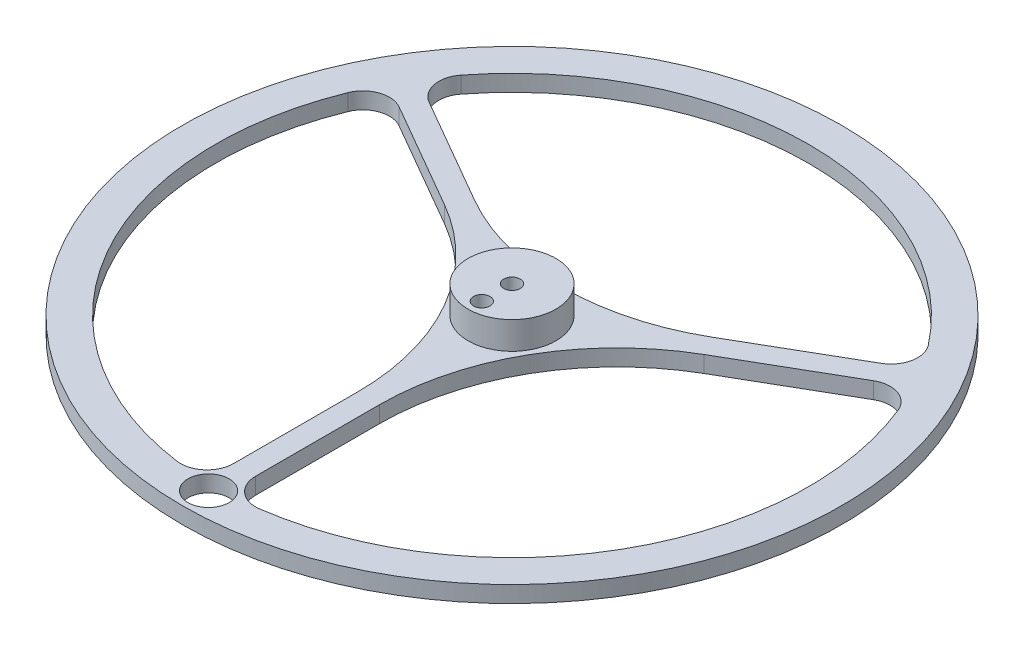
ISO-10303-21;
HEADER;
FILE_DESCRIPTION(('STEP AP214'),'2;1');
FILE_NAME('part.step','',(''),(''),'','','');
FILE_SCHEMA(('AUTOMOTIVE_DESIGN { 1 0 10303 214 1 1 1 1 }'));
ENDSEC;
DATA;
#1=APPLICATION_CONTEXT('core data for automotive mechanical design processes');
#2=APPLICATION_PROTOCOL_DEFINITION('international standard','automotive_design',2000,#1);
#3=PRODUCT_CONTEXT('',#1,'mechanical');
#4=PRODUCT('Part','Part','',(#3));
#5=PRODUCT_RELATED_PRODUCT_CATEGORY('part','',(#4));
#6=PRODUCT_DEFINITION_FORMATION('','',#4);
#7=PRODUCT_DEFINITION_CONTEXT('part definition',#1,'design');
#8=PRODUCT_DEFINITION('design','',#6,#7);
#9=PRODUCT_DEFINITION_SHAPE('','',#8);
#10=(LENGTH_UNIT() NAMED_UNIT(*) SI_UNIT(.MILLI.,.METRE.));
#11=(NAMED_UNIT(*) PLANE_ANGLE_UNIT() SI_UNIT($,.RADIAN.));
#12=(NAMED_UNIT(*) SI_UNIT($,.STERADIAN.) SOLID_ANGLE_UNIT());
#13=UNCERTAINTY_MEASURE_WITH_UNIT(LENGTH_MEASURE(1.E-05),#10,'distance_accuracy_value','');
#14=(GEOMETRIC_REPRESENTATION_CONTEXT(3) GLOBAL_UNCERTAINTY_ASSIGNED_CONTEXT((#13)) GLOBAL_UNIT_ASSIGNED_CONTEXT((#10,
#11,#12)) REPRESENTATION_CONTEXT('',''));
#15=CARTESIAN_POINT('',(0.,0.,0.));
#16=DIRECTION('',(0.,0.,1.));
#17=DIRECTION('',(1.,0.,0.));
#18=AXIS2_PLACEMENT_3D('',#15,#16,#17);
#19=CARTESIAN_POINT('',(-132.141421356237,0.,0.));
#20=DIRECTION('',(0.,1.,0.));
#21=DIRECTION('',(0.,0.,1.));
#22=AXIS2_PLACEMENT_3D('',#19,#20,#21);
#23=PLANE('',#22);
#24=CARTESIAN_POINT('',(0.,0.,55.25));
#25=DIRECTION('',(0.,1.,0.));
#26=DIRECTION('',(0.,0.,1.));
#27=AXIS2_PLACEMENT_3D('',#24,#25,#26);
#28=CIRCLE('',#27,3.75);
#29=CARTESIAN_POINT('',(0.,0.,59.));
#30=VERTEX_POINT('',#29);
#31=EDGE_CURVE('E499',#30,#30,#28,.T.);
#32=ORIENTED_EDGE('',*,*,#31,.F.);
#33=EDGE_LOOP('',(#32));
#34=FACE_BOUND('',#33,.T.);
#35=CARTESIAN_POINT('',(0.,0.,0.));
#36=DIRECTION('',(0.,1.,0.));
#37=DIRECTION('',(0.,0.,1.));
#38=AXIS2_PLACEMENT_3D('',#35,#36,#37);
#39=CIRCLE('',#38,60.);
#40=CARTESIAN_POINT('',(0.,0.,60.));
#41=VERTEX_POINT('',#40);
#42=EDGE_CURVE('E239',#41,#41,#39,.T.);
#43=ORIENTED_EDGE('',*,*,#42,.T.);
#44=EDGE_LOOP('',(#43));
#45=FACE_BOUND('',#44,.T.);
#46=CARTESIAN_POINT('',(0.,0.,0.));
#47=DIRECTION('',(0.,1.,0.));
#48=DIRECTION('',(0.,0.,1.));
#49=AXIS2_PLACEMENT_3D('',#46,#47,#48);
#50=CIRCLE('',#49,54.);
#51=CARTESIAN_POINT('',(-50.0621204437888,0.,-20.2431246765806));
#52=VERTEX_POINT('',#51);
#53=CARTESIAN_POINT('',(-7.5,0.,53.4766304099277));
#54=VERTEX_POINT('',#53);
#55=EDGE_CURVE('E202',#52,#54,#50,.T.);
#56=ORIENTED_EDGE('',*,*,#55,.F.);
#57=CARTESIAN_POINT('',(-45.5850204078836,0.,-18.4327640004259));
#58=DIRECTION('',(0.,1.,0.));
#59=DIRECTION('',(0.,0.,1.));
#60=AXIS2_PLACEMENT_3D('',#57,#58,#59);
#61=CIRCLE('',#60,4.82926811321019);
#62=CARTESIAN_POINT('',(-43.1703863512785,0.,-22.6150328681521));
#63=VERTEX_POINT('',#62);
#64=EDGE_CURVE('E228',#63,#52,#61,.T.);
#65=ORIENTED_EDGE('',*,*,#64,.F.);
#66=DIRECTION('',(0.866025403784437,0.,0.500000000000002));
#67=VECTOR('',#66,1.);
#68=CARTESIAN_POINT('',(-100.106066119377,0.,-55.4868629087586));
#69=LINE('',#68,#67);
#70=CARTESIAN_POINT('',(-23.6243550945525,0.,-11.3301264604924));
#71=VERTEX_POINT('',#70);
#72=EDGE_CURVE('E230',#63,#71,#69,.T.);
#73=ORIENTED_EDGE('',*,*,#72,.T.);
#74=CARTESIAN_POINT('',(-45.2487099847053,0.,26.124354890153));
#75=DIRECTION('',(0.,1.,0.));
#76=DIRECTION('',(0.,0.,1.));
#77=AXIS2_PLACEMENT_3D('',#74,#75,#76);
#78=CIRCLE('',#77,43.2487097803058);
#79=CARTESIAN_POINT('',(-2.0000002043995,0.,26.1243548901531));
#80=VERTEX_POINT('',#79);
#81=EDGE_CURVE('E233',#80,#71,#78,.T.);
#82=ORIENTED_EDGE('',*,*,#81,.F.);
#83=DIRECTION('',(0.,0.,1.));
#84=VECTOR('',#83,1.);
#85=CARTESIAN_POINT('',(-2.0000002043995,0.,0.));
#86=LINE('',#85,#84);
#87=CARTESIAN_POINT('',(-2.0000002043995,0.,48.6941677054723));
#88=VERTEX_POINT('',#87);
#89=EDGE_CURVE('E174',#80,#88,#86,.T.);
#90=ORIENTED_EDGE('',*,*,#89,.T.);
#91=CARTESIAN_POINT('',(-6.8292683176097,0.,48.6941677054723));
#92=DIRECTION('',(0.,1.,0.));
#93=DIRECTION('',(0.,0.,1.));
#94=AXIS2_PLACEMENT_3D('',#91,#92,#93);
#95=CIRCLE('',#94,4.82926811321019);
#96=EDGE_CURVE('E236',#88,#54,#95,.F.);
#97=ORIENTED_EDGE('',*,*,#96,.T.);
#98=EDGE_LOOP('',(#56,#65,#73,#82,#90,#97));
#99=FACE_BOUND('',#98,.T.);
#100=CARTESIAN_POINT('',(42.5621204437888,0.,-33.2335057333471));
#101=VERTEX_POINT('',#100);
#102=CARTESIAN_POINT('',(-42.5621204437888,0.,-33.2335057333471));
#103=VERTEX_POINT('',#102);
#104=EDGE_CURVE('E203',#101,#103,#50,.T.);
#105=ORIENTED_EDGE('',*,*,#104,.F.);
#106=CARTESIAN_POINT('',(38.755752090274,0.,-30.2614037050463));
#107=DIRECTION('',(0.,1.,0.));
#108=DIRECTION('',(0.,0.,1.));
#109=AXIS2_PLACEMENT_3D('',#106,#107,#108);
#110=CIRCLE('',#109,4.82926811321023);
#111=CARTESIAN_POINT('',(41.1703861468791,0.,-26.0791348373201));
#112=VERTEX_POINT('',#111);
#113=EDGE_CURVE('E217',#112,#101,#110,.T.);
#114=ORIENTED_EDGE('',*,*,#113,.F.);
#115=DIRECTION('',(0.86602540378444,0.,-0.499999999999999));
#116=VECTOR('',#115,1.);
#117=CARTESIAN_POINT('',(-100.106066119378,0.,55.4868629087584));
#118=LINE('',#117,#116);
#119=CARTESIAN_POINT('',(21.624354890153,0.,-14.7942284296605));
#120=VERTEX_POINT('',#119);
#121=EDGE_CURVE('E219',#120,#112,#118,.T.);
#122=ORIENTED_EDGE('',*,*,#121,.F.);
#123=CARTESIAN_POINT('',(0.,0.,-52.2487097803058));
#124=DIRECTION('',(0.,1.,0.));
#125=DIRECTION('',(0.,0.,1.));
#126=AXIS2_PLACEMENT_3D('',#123,#124,#125);
#127=CIRCLE('',#126,43.2487097803058);
#128=CARTESIAN_POINT('',(-21.624354890153,0.,-14.7942284296605));
#129=VERTEX_POINT('',#128);
#130=EDGE_CURVE('E221',#129,#120,#127,.T.);
#131=ORIENTED_EDGE('',*,*,#130,.F.);
#132=DIRECTION('',(0.866025403784438,0.,0.500000000000002));
#133=VECTOR('',#132,1.);
#134=CARTESIAN_POINT('',(-98.1060659149781,0.,-58.9509648779266));
#135=LINE('',#134,#133);
#136=CARTESIAN_POINT('',(-41.170386146879,0.,-26.0791348373202));
#137=VERTEX_POINT('',#136);
#138=EDGE_CURVE('E223',#137,#129,#135,.T.);
#139=ORIENTED_EDGE('',*,*,#138,.F.);
#140=CARTESIAN_POINT('',(-38.7557520902739,0.,-30.2614037050463));
#141=DIRECTION('',(0.,1.,0.));
#142=DIRECTION('',(0.,0.,1.));
#143=AXIS2_PLACEMENT_3D('',#140,#141,#142);
#144=CIRCLE('',#143,4.82926811321019);
#145=EDGE_CURVE('E225',#137,#103,#144,.F.);
#146=ORIENTED_EDGE('',*,*,#145,.T.);
#147=EDGE_LOOP('',(#105,#114,#122,#131,#139,#146));
#148=FACE_BOUND('',#147,.T.);
#149=CARTESIAN_POINT('',(7.5,0.,53.4766304099277));
#150=VERTEX_POINT('',#149);
#151=CARTESIAN_POINT('',(50.0621204437888,0.,-20.2431246765805));
#152=VERTEX_POINT('',#151);
#153=EDGE_CURVE('E197',#150,#152,#50,.T.);
#154=ORIENTED_EDGE('',*,*,#153,.F.);
#155=CARTESIAN_POINT('',(6.8292683176097,0.,48.6941677054723));
#156=DIRECTION('',(0.,1.,0.));
#157=DIRECTION('',(0.,0.,1.));
#158=AXIS2_PLACEMENT_3D('',#155,#156,#157);
#159=CIRCLE('',#158,4.82926811321019);
#160=CARTESIAN_POINT('',(2.0000002043995,0.,48.6941677054723));
#161=VERTEX_POINT('',#160);
#162=EDGE_CURVE('E200',#161,#150,#159,.T.);
#163=ORIENTED_EDGE('',*,*,#162,.F.);
#164=DIRECTION('',(0.,0.,-1.));
#165=VECTOR('',#164,1.);
#166=CARTESIAN_POINT('',(2.0000002043995,0.,0.));
#167=LINE('',#166,#165);
#168=CARTESIAN_POINT('',(2.0000002043995,0.,26.1243548901531));
#169=VERTEX_POINT('',#168);
#170=EDGE_CURVE('E205',#161,#169,#167,.T.);
#171=ORIENTED_EDGE('',*,*,#170,.T.);
#172=CARTESIAN_POINT('',(45.2487099847054,0.,26.124354890153));
#173=DIRECTION('',(0.,1.,0.));
#174=DIRECTION('',(0.,0.,1.));
#175=AXIS2_PLACEMENT_3D('',#172,#173,#174);
#176=CIRCLE('',#175,43.2487097803058);
#177=CARTESIAN_POINT('',(23.6243550945525,0.,-11.3301264604924));
#178=VERTEX_POINT('',#177);
#179=EDGE_CURVE('E208',#178,#169,#176,.T.);
#180=ORIENTED_EDGE('',*,*,#179,.F.);
#181=DIRECTION('',(0.866025403784439,0.,-0.5));
#182=VECTOR('',#181,1.);
#183=CARTESIAN_POINT('',(-98.1060659149782,0.,58.9509648779266));
#184=LINE('',#183,#182);
#185=CARTESIAN_POINT('',(43.1703863512786,0.,-22.615032868152));
#186=VERTEX_POINT('',#185);
#187=EDGE_CURVE('E211',#178,#186,#184,.T.);
#188=ORIENTED_EDGE('',*,*,#187,.T.);
#189=CARTESIAN_POINT('',(45.5850204078837,0.,-18.4327640004259));
#190=DIRECTION('',(0.,1.,0.));
#191=DIRECTION('',(0.,0.,1.));
#192=AXIS2_PLACEMENT_3D('',#189,#190,#191);
#193=CIRCLE('',#192,4.8292681132102);
#194=EDGE_CURVE('E214',#186,#152,#193,.F.);
#195=ORIENTED_EDGE('',*,*,#194,.T.);
#196=EDGE_LOOP('',(#154,#163,#171,#180,#188,#195));
#197=FACE_BOUND('',#196,.T.);
#198=CARTESIAN_POINT('',(0.,0.,0.));
#199=DIRECTION('',(0.,1.,0.));
#200=DIRECTION('',(0.,0.,1.));
#201=AXIS2_PLACEMENT_3D('',#198,#199,#200);
#202=CIRCLE('',#201,8.);
#203=CARTESIAN_POINT('',(0.,0.,8.));
#204=VERTEX_POINT('',#203);
#205=EDGE_CURVE('E516',#204,#204,#202,.T.);
#206=ORIENTED_EDGE('',*,*,#205,.F.);
#207=EDGE_LOOP('',(#206));
#208=FACE_BOUND('',#207,.T.);
#209=ADVANCED_FACE('F36',(#34,#45,#99,#148,#197,#208),#23,.T.);
#210=CARTESIAN_POINT('',(0.,-3.,0.));
#211=DIRECTION('',(0.,1.,0.));
#212=DIRECTION('',(0.,0.,1.));
#213=AXIS2_PLACEMENT_3D('',#210,#211,#212);
#214=CYLINDRICAL_SURFACE('',#213,54.);
#215=ORIENTED_EDGE('',*,*,#55,.T.);
#216=DIRECTION('',(0.,1.,0.));
#217=VECTOR('',#216,1.);
#218=CARTESIAN_POINT('',(-7.5,-3.,53.4766304099277));
#219=LINE('',#218,#217);
#220=CARTESIAN_POINT('',(-7.5,-3.,53.4766304099277));
#221=VERTEX_POINT('',#220);
#222=EDGE_CURVE('E11',#221,#54,#219,.T.);
#223=ORIENTED_EDGE('',*,*,#222,.F.);
#224=CARTESIAN_POINT('',(0.,-3.,0.));
#225=DIRECTION('',(0.,1.,0.));
#226=DIRECTION('',(0.,0.,1.));
#227=AXIS2_PLACEMENT_3D('',#224,#225,#226);
#228=CIRCLE('',#227,54.);
#229=CARTESIAN_POINT('',(-50.0621204437888,-3.,-20.2431246765806));
#230=VERTEX_POINT('',#229);
#231=EDGE_CURVE('E55',#230,#221,#228,.T.);
#232=ORIENTED_EDGE('',*,*,#231,.F.);
#233=DIRECTION('',(0.,1.,0.));
#234=VECTOR('',#233,1.);
#235=CARTESIAN_POINT('',(-50.0621204437888,-3.,-20.2431246765806));
#236=LINE('',#235,#234);
#237=EDGE_CURVE('E247',#230,#52,#236,.T.);
#238=ORIENTED_EDGE('',*,*,#237,.T.);
#239=EDGE_LOOP('',(#215,#223,#232,#238));
#240=FACE_BOUND('',#239,.T.);
#241=ADVANCED_FACE('F325',(#240),#214,.F.);
#242=CARTESIAN_POINT('',(-6.8292683176097,-3.,48.6941677054723));
#243=DIRECTION('',(0.,1.,0.));
#244=DIRECTION('',(0.,0.,1.));
#245=AXIS2_PLACEMENT_3D('',#242,#243,#244);
#246=CYLINDRICAL_SURFACE('',#245,4.82926811321019);
#247=ORIENTED_EDGE('',*,*,#96,.F.);
#248=DIRECTION('',(0.,1.,0.));
#249=VECTOR('',#248,1.);
#250=CARTESIAN_POINT('',(-2.0000002043995,-3.,48.6941677054723));
#251=LINE('',#250,#249);
#252=CARTESIAN_POINT('',(-2.0000002043995,-3.,48.6941677054723));
#253=VERTEX_POINT('',#252);
#254=EDGE_CURVE('E46',#253,#88,#251,.T.);
#255=ORIENTED_EDGE('',*,*,#254,.F.);
#256=CARTESIAN_POINT('',(-6.8292683176097,-3.,48.6941677054723));
#257=DIRECTION('',(0.,1.,0.));
#258=DIRECTION('',(0.,0.,1.));
#259=AXIS2_PLACEMENT_3D('',#256,#257,#258);
#260=CIRCLE('',#259,4.82926811321019);
#261=EDGE_CURVE('E189',#253,#221,#260,.F.);
#262=ORIENTED_EDGE('',*,*,#261,.T.);
#263=ORIENTED_EDGE('',*,*,#222,.T.);
#264=EDGE_LOOP('',(#247,#255,#262,#263));
#265=FACE_BOUND('',#264,.T.);
#266=ADVANCED_FACE('F355',(#265),#246,.F.);
#267=CARTESIAN_POINT('',(-2.0000002043995,-3.,0.));
#268=DIRECTION('',(-1.,0.,0.));
#269=DIRECTION('',(0.,0.,1.));
#270=AXIS2_PLACEMENT_3D('',#267,#268,#269);
#271=PLANE('',#270);
#272=ORIENTED_EDGE('',*,*,#89,.F.);
#273=DIRECTION('',(0.,1.,0.));
#274=VECTOR('',#273,1.);
#275=CARTESIAN_POINT('',(-2.0000002043995,-3.,26.1243548901531));
#276=LINE('',#275,#274);
#277=CARTESIAN_POINT('',(-2.0000002043995,-3.,26.1243548901531));
#278=VERTEX_POINT('',#277);
#279=EDGE_CURVE('E169',#278,#80,#276,.T.);
#280=ORIENTED_EDGE('',*,*,#279,.F.);
#281=DIRECTION('',(0.,0.,1.));
#282=VECTOR('',#281,1.);
#283=CARTESIAN_POINT('',(-2.0000002043995,-3.,0.));
#284=LINE('',#283,#282);
#285=EDGE_CURVE('E173',#278,#253,#284,.T.);
#286=ORIENTED_EDGE('',*,*,#285,.T.);
#287=ORIENTED_EDGE('',*,*,#254,.T.);
#288=EDGE_LOOP('',(#272,#280,#286,#287));
#289=FACE_BOUND('',#288,.T.);
#290=ADVANCED_FACE('F171',(#289),#271,.T.);
#291=CARTESIAN_POINT('',(-45.2487099847053,-3.,26.124354890153));
#292=DIRECTION('',(0.,1.,0.));
#293=DIRECTION('',(0.,0.,1.));
#294=AXIS2_PLACEMENT_3D('',#291,#292,#293);
#295=CYLINDRICAL_SURFACE('',#294,43.2487097803058);
#296=ORIENTED_EDGE('',*,*,#81,.T.);
#297=DIRECTION('',(0.,1.,0.));
#298=VECTOR('',#297,1.);
#299=CARTESIAN_POINT('',(-23.6243550945525,-3.,-11.3301264604924));
#300=LINE('',#299,#298);
#301=CARTESIAN_POINT('',(-23.6243550945525,-3.,-11.3301264604924));
#302=VERTEX_POINT('',#301);
#303=EDGE_CURVE('E178',#302,#71,#300,.T.);
#304=ORIENTED_EDGE('',*,*,#303,.F.);
#305=CARTESIAN_POINT('',(-45.2487099847053,-3.,26.124354890153));
#306=DIRECTION('',(0.,1.,0.));
#307=DIRECTION('',(0.,0.,1.));
#308=AXIS2_PLACEMENT_3D('',#305,#306,#307);
#309=CIRCLE('',#308,43.2487097803058);
#310=EDGE_CURVE('E181',#278,#302,#309,.T.);
#311=ORIENTED_EDGE('',*,*,#310,.F.);
#312=ORIENTED_EDGE('',*,*,#279,.T.);
#313=EDGE_LOOP('',(#296,#304,#311,#312));
#314=FACE_BOUND('',#313,.T.);
#315=ADVANCED_FACE('F182',(#314),#295,.F.);
#316=CARTESIAN_POINT('',(-100.106066119377,-3.,-55.4868629087586));
#317=DIRECTION('',(-0.500000000000002,0.,0.866025403784437));
#318=DIRECTION('',(0.866025403784437,0.,0.500000000000002));
#319=AXIS2_PLACEMENT_3D('',#316,#317,#318);
#320=PLANE('',#319);
#321=ORIENTED_EDGE('',*,*,#72,.F.);
#322=DIRECTION('',(0.,1.,0.));
#323=VECTOR('',#322,1.);
#324=CARTESIAN_POINT('',(-43.1703863512785,-3.,-22.6150328681521));
#325=LINE('',#324,#323);
#326=CARTESIAN_POINT('',(-43.1703863512785,-3.,-22.6150328681521));
#327=VERTEX_POINT('',#326);
#328=EDGE_CURVE('E245',#327,#63,#325,.T.);
#329=ORIENTED_EDGE('',*,*,#328,.F.);
#330=DIRECTION('',(0.866025403784437,0.,0.500000000000002));
#331=VECTOR('',#330,1.);
#332=CARTESIAN_POINT('',(-100.106066119377,-3.,-55.4868629087586));
#333=LINE('',#332,#331);
#334=EDGE_CURVE('E185',#327,#302,#333,.T.);
#335=ORIENTED_EDGE('',*,*,#334,.T.);
#336=ORIENTED_EDGE('',*,*,#303,.T.);
#337=EDGE_LOOP('',(#321,#329,#335,#336));
#338=FACE_BOUND('',#337,.T.);
#339=ADVANCED_FACE('F317',(#338),#320,.T.);
#340=ORIENTED_EDGE('',*,*,#104,.T.);
#341=DIRECTION('',(0.,1.,0.));
#342=VECTOR('',#341,1.);
#343=CARTESIAN_POINT('',(-42.5621204437888,-3.,-33.2335057333471));
#344=LINE('',#343,#342);
#345=CARTESIAN_POINT('',(-42.5621204437888,-3.,-33.2335057333471));
#346=VERTEX_POINT('',#345);
#347=EDGE_CURVE('E250',#346,#103,#344,.T.);
#348=ORIENTED_EDGE('',*,*,#347,.F.);
#349=CARTESIAN_POINT('',(42.5621204437888,-3.,-33.2335057333471));
#350=VERTEX_POINT('',#349);
#351=EDGE_CURVE('E295',#350,#346,#228,.T.);
#352=ORIENTED_EDGE('',*,*,#351,.F.);
#353=DIRECTION('',(0.,1.,0.));
#354=VECTOR('',#353,1.);
#355=CARTESIAN_POINT('',(42.5621204437888,-3.,-33.2335057333471));
#356=LINE('',#355,#354);
#357=EDGE_CURVE('E263',#350,#101,#356,.T.);
#358=ORIENTED_EDGE('',*,*,#357,.T.);
#359=EDGE_LOOP('',(#340,#348,#352,#358));
#360=FACE_BOUND('',#359,.T.);
#361=ADVANCED_FACE('F357',(#360),#214,.F.);
#362=CARTESIAN_POINT('',(-38.7557520902739,-3.,-30.2614037050463));
#363=DIRECTION('',(0.,1.,0.));
#364=DIRECTION('',(0.,0.,1.));
#365=AXIS2_PLACEMENT_3D('',#362,#363,#364);
#366=CYLINDRICAL_SURFACE('',#365,4.82926811321019);
#367=ORIENTED_EDGE('',*,*,#145,.F.);
#368=DIRECTION('',(0.,1.,0.));
#369=VECTOR('',#368,1.);
#370=CARTESIAN_POINT('',(-41.170386146879,-3.,-26.0791348373202));
#371=LINE('',#370,#369);
#372=CARTESIAN_POINT('',(-41.170386146879,-3.,-26.0791348373202));
#373=VERTEX_POINT('',#372);
#374=EDGE_CURVE('E252',#373,#137,#371,.T.);
#375=ORIENTED_EDGE('',*,*,#374,.F.);
#376=CARTESIAN_POINT('',(-38.7557520902739,-3.,-30.2614037050463));
#377=DIRECTION('',(0.,1.,0.));
#378=DIRECTION('',(0.,0.,1.));
#379=AXIS2_PLACEMENT_3D('',#376,#377,#378);
#380=CIRCLE('',#379,4.82926811321019);
#381=EDGE_CURVE('E311',#373,#346,#380,.F.);
#382=ORIENTED_EDGE('',*,*,#381,.T.);
#383=ORIENTED_EDGE('',*,*,#347,.T.);
#384=EDGE_LOOP('',(#367,#375,#382,#383));
#385=FACE_BOUND('',#384,.T.);
#386=ADVANCED_FACE('F373',(#385),#366,.F.);
#387=CARTESIAN_POINT('',(-98.1060659149781,-3.,-58.9509648779266));
#388=DIRECTION('',(-0.500000000000001,0.,0.866025403784438));
#389=DIRECTION('',(0.866025403784438,0.,0.500000000000002));
#390=AXIS2_PLACEMENT_3D('',#387,#388,#389);
#391=PLANE('',#390);
#392=ORIENTED_EDGE('',*,*,#138,.T.);
#393=DIRECTION('',(0.,1.,0.));
#394=VECTOR('',#393,1.);
#395=CARTESIAN_POINT('',(-21.624354890153,-3.,-14.7942284296605));
#396=LINE('',#395,#394);
#397=CARTESIAN_POINT('',(-21.624354890153,-3.,-14.7942284296605));
#398=VERTEX_POINT('',#397);
#399=EDGE_CURVE('E254',#398,#129,#396,.T.);
#400=ORIENTED_EDGE('',*,*,#399,.F.);
#401=DIRECTION('',(0.866025403784438,0.,0.500000000000002));
#402=VECTOR('',#401,1.);
#403=CARTESIAN_POINT('',(-98.1060659149781,-3.,-58.9509648779266));
#404=LINE('',#403,#402);
#405=EDGE_CURVE('E309',#373,#398,#404,.T.);
#406=ORIENTED_EDGE('',*,*,#405,.F.);
#407=ORIENTED_EDGE('',*,*,#374,.T.);
#408=EDGE_LOOP('',(#392,#400,#406,#407));
#409=FACE_BOUND('',#408,.T.);
#410=ADVANCED_FACE('F376',(#409),#391,.F.);
#411=CARTESIAN_POINT('',(0.,-3.,-52.2487097803058));
#412=DIRECTION('',(0.,1.,0.));
#413=DIRECTION('',(0.,0.,1.));
#414=AXIS2_PLACEMENT_3D('',#411,#412,#413);
#415=CYLINDRICAL_SURFACE('',#414,43.2487097803058);
#416=ORIENTED_EDGE('',*,*,#130,.T.);
#417=DIRECTION('',(0.,1.,0.));
#418=VECTOR('',#417,1.);
#419=CARTESIAN_POINT('',(21.624354890153,-3.,-14.7942284296605));
#420=LINE('',#419,#418);
#421=CARTESIAN_POINT('',(21.624354890153,-3.,-14.7942284296605));
#422=VERTEX_POINT('',#421);
#423=EDGE_CURVE('E257',#422,#120,#420,.T.);
#424=ORIENTED_EDGE('',*,*,#423,.F.);
#425=CARTESIAN_POINT('',(0.,-3.,-52.2487097803058));
#426=DIRECTION('',(0.,1.,0.));
#427=DIRECTION('',(0.,0.,1.));
#428=AXIS2_PLACEMENT_3D('',#425,#426,#427);
#429=CIRCLE('',#428,43.2487097803058);
#430=EDGE_CURVE('E307',#398,#422,#429,.T.);
#431=ORIENTED_EDGE('',*,*,#430,.F.);
#432=ORIENTED_EDGE('',*,*,#399,.T.);
#433=EDGE_LOOP('',(#416,#424,#431,#432));
#434=FACE_BOUND('',#433,.T.);
#435=ADVANCED_FACE('F380',(#434),#415,.F.);
#436=CARTESIAN_POINT('',(-100.106066119378,-3.,55.4868629087584));
#437=DIRECTION('',(0.499999999999999,0.,0.866025403784439));
#438=DIRECTION('',(0.866025403784439,0.,-0.499999999999999));
#439=AXIS2_PLACEMENT_3D('',#436,#437,#438);
#440=PLANE('',#439);
#441=ORIENTED_EDGE('',*,*,#121,.T.);
#442=DIRECTION('',(0.,1.,0.));
#443=VECTOR('',#442,1.);
#444=CARTESIAN_POINT('',(41.1703861468791,-3.,-26.0791348373201));
#445=LINE('',#444,#443);
#446=CARTESIAN_POINT('',(41.1703861468791,-3.,-26.0791348373201));
#447=VERTEX_POINT('',#446);
#448=EDGE_CURVE('E260',#447,#112,#445,.T.);
#449=ORIENTED_EDGE('',*,*,#448,.F.);
#450=DIRECTION('',(0.86602540378444,0.,-0.499999999999999));
#451=VECTOR('',#450,1.);
#452=CARTESIAN_POINT('',(-100.106066119378,-3.,55.4868629087584));
#453=LINE('',#452,#451);
#454=EDGE_CURVE('E305',#422,#447,#453,.T.);
#455=ORIENTED_EDGE('',*,*,#454,.F.);
#456=ORIENTED_EDGE('',*,*,#423,.T.);
#457=EDGE_LOOP('',(#441,#449,#455,#456));
#458=FACE_BOUND('',#457,.T.);
#459=ADVANCED_FACE('F384',(#458),#440,.F.);
#460=ORIENTED_EDGE('',*,*,#153,.T.);
#461=DIRECTION('',(0.,1.,0.));
#462=VECTOR('',#461,1.);
#463=CARTESIAN_POINT('',(50.0621204437888,-3.,-20.2431246765805));
#464=LINE('',#463,#462);
#465=CARTESIAN_POINT('',(50.0621204437888,-3.,-20.2431246765805));
#466=VERTEX_POINT('',#465);
#467=EDGE_CURVE('E266',#466,#152,#464,.T.);
#468=ORIENTED_EDGE('',*,*,#467,.F.);
#469=CARTESIAN_POINT('',(7.5,-3.,53.4766304099277));
#470=VERTEX_POINT('',#469);
#471=EDGE_CURVE('E241',#470,#466,#228,.T.);
#472=ORIENTED_EDGE('',*,*,#471,.F.);
#473=DIRECTION('',(0.,1.,0.));
#474=VECTOR('',#473,1.);
#475=CARTESIAN_POINT('',(7.5,-3.,53.4766304099277));
#476=LINE('',#475,#474);
#477=EDGE_CURVE('E40',#470,#150,#476,.T.);
#478=ORIENTED_EDGE('',*,*,#477,.T.);
#479=EDGE_LOOP('',(#460,#468,#472,#478));
#480=FACE_BOUND('',#479,.T.);
#481=ADVANCED_FACE('F280',(#480),#214,.F.);
#482=CARTESIAN_POINT('',(45.5850204078837,-3.,-18.4327640004259));
#483=DIRECTION('',(0.,1.,0.));
#484=DIRECTION('',(0.,0.,1.));
#485=AXIS2_PLACEMENT_3D('',#482,#483,#484);
#486=CYLINDRICAL_SURFACE('',#485,4.8292681132102);
#487=ORIENTED_EDGE('',*,*,#194,.F.);
#488=DIRECTION('',(0.,1.,0.));
#489=VECTOR('',#488,1.);
#490=CARTESIAN_POINT('',(43.1703863512786,-3.,-22.615032868152));
#491=LINE('',#490,#489);
#492=CARTESIAN_POINT('',(43.1703863512786,-3.,-22.615032868152));
#493=VERTEX_POINT('',#492);
#494=EDGE_CURVE('E268',#493,#186,#491,.T.);
#495=ORIENTED_EDGE('',*,*,#494,.F.);
#496=CARTESIAN_POINT('',(45.5850204078837,-3.,-18.4327640004259));
#497=DIRECTION('',(0.,1.,0.));
#498=DIRECTION('',(0.,0.,1.));
#499=AXIS2_PLACEMENT_3D('',#496,#497,#498);
#500=CIRCLE('',#499,4.8292681132102);
#501=EDGE_CURVE('E293',#493,#466,#500,.F.);
#502=ORIENTED_EDGE('',*,*,#501,.T.);
#503=ORIENTED_EDGE('',*,*,#467,.T.);
#504=EDGE_LOOP('',(#487,#495,#502,#503));
#505=FACE_BOUND('',#504,.T.);
#506=ADVANCED_FACE('F289',(#505),#486,.F.);
#507=CARTESIAN_POINT('',(-98.1060659149782,-3.,58.9509648779266));
#508=DIRECTION('',(0.5,0.,0.866025403784439));
#509=DIRECTION('',(0.866025403784439,0.,-0.5));
#510=AXIS2_PLACEMENT_3D('',#507,#508,#509);
#511=PLANE('',#510);
#512=ORIENTED_EDGE('',*,*,#187,.F.);
#513=DIRECTION('',(0.,1.,0.));
#514=VECTOR('',#513,1.);
#515=CARTESIAN_POINT('',(23.6243550945525,-3.,-11.3301264604924));
#516=LINE('',#515,#514);
#517=CARTESIAN_POINT('',(23.6243550945525,-3.,-11.3301264604924));
#518=VERTEX_POINT('',#517);
#519=EDGE_CURVE('E270',#518,#178,#516,.T.);
#520=ORIENTED_EDGE('',*,*,#519,.F.);
#521=DIRECTION('',(0.866025403784439,0.,-0.5));
#522=VECTOR('',#521,1.);
#523=CARTESIAN_POINT('',(-98.1060659149782,-3.,58.9509648779266));
#524=LINE('',#523,#522);
#525=EDGE_CURVE('E296',#518,#493,#524,.T.);
#526=ORIENTED_EDGE('',*,*,#525,.T.);
#527=ORIENTED_EDGE('',*,*,#494,.T.);
#528=EDGE_LOOP('',(#512,#520,#526,#527));
#529=FACE_BOUND('',#528,.T.);
#530=ADVANCED_FACE('F391',(#529),#511,.T.);
#531=CARTESIAN_POINT('',(45.2487099847054,-3.,26.124354890153));
#532=DIRECTION('',(0.,1.,0.));
#533=DIRECTION('',(0.,0.,1.));
#534=AXIS2_PLACEMENT_3D('',#531,#532,#533);
#535=CYLINDRICAL_SURFACE('',#534,43.2487097803058);
#536=ORIENTED_EDGE('',*,*,#179,.T.);
#537=DIRECTION('',(0.,1.,0.));
#538=VECTOR('',#537,1.);
#539=CARTESIAN_POINT('',(2.0000002043995,-3.,26.1243548901531));
#540=LINE('',#539,#538);
#541=CARTESIAN_POINT('',(2.0000002043995,-3.,26.1243548901531));
#542=VERTEX_POINT('',#541);
#543=EDGE_CURVE('E272',#542,#169,#540,.T.);
#544=ORIENTED_EDGE('',*,*,#543,.F.);
#545=CARTESIAN_POINT('',(45.2487099847054,-3.,26.124354890153));
#546=DIRECTION('',(0.,1.,0.));
#547=DIRECTION('',(0.,0.,1.));
#548=AXIS2_PLACEMENT_3D('',#545,#546,#547);
#549=CIRCLE('',#548,43.2487097803058);
#550=EDGE_CURVE('E300',#518,#542,#549,.T.);
#551=ORIENTED_EDGE('',*,*,#550,.F.);
#552=ORIENTED_EDGE('',*,*,#519,.T.);
#553=EDGE_LOOP('',(#536,#544,#551,#552));
#554=FACE_BOUND('',#553,.T.);
#555=ADVANCED_FACE('F335',(#554),#535,.F.);
#556=CARTESIAN_POINT('',(2.0000002043995,-3.,0.));
#557=DIRECTION('',(1.,0.,0.));
#558=DIRECTION('',(0.,0.,-1.));
#559=AXIS2_PLACEMENT_3D('',#556,#557,#558);
#560=PLANE('',#559);
#561=ORIENTED_EDGE('',*,*,#170,.F.);
#562=DIRECTION('',(0.,1.,0.));
#563=VECTOR('',#562,1.);
#564=CARTESIAN_POINT('',(2.0000002043995,-3.,48.6941677054723));
#565=LINE('',#564,#563);
#566=CARTESIAN_POINT('',(2.0000002043995,-3.,48.6941677054723));
#567=VERTEX_POINT('',#566);
#568=EDGE_CURVE('E273',#567,#161,#565,.T.);
#569=ORIENTED_EDGE('',*,*,#568,.F.);
#570=DIRECTION('',(0.,0.,-1.));
#571=VECTOR('',#570,1.);
#572=CARTESIAN_POINT('',(2.0000002043995,-3.,0.));
#573=LINE('',#572,#571);
#574=EDGE_CURVE('E328',#567,#542,#573,.T.);
#575=ORIENTED_EDGE('',*,*,#574,.T.);
#576=ORIENTED_EDGE('',*,*,#543,.T.);
#577=EDGE_LOOP('',(#561,#569,#575,#576));
#578=FACE_BOUND('',#577,.T.);
#579=ADVANCED_FACE('F337',(#578),#560,.T.);
#580=CARTESIAN_POINT('',(-45.5850204078836,-3.,-18.4327640004259));
#581=DIRECTION('',(0.,1.,0.));
#582=DIRECTION('',(0.,0.,1.));
#583=AXIS2_PLACEMENT_3D('',#580,#581,#582);
#584=CYLINDRICAL_SURFACE('',#583,4.82926811321019);
#585=ORIENTED_EDGE('',*,*,#64,.T.);
#586=ORIENTED_EDGE('',*,*,#237,.F.);
#587=CARTESIAN_POINT('',(-45.5850204078836,-3.,-18.4327640004259));
#588=DIRECTION('',(0.,1.,0.));
#589=DIRECTION('',(0.,0.,1.));
#590=AXIS2_PLACEMENT_3D('',#587,#588,#589);
#591=CIRCLE('',#590,4.82926811321019);
#592=EDGE_CURVE('E314',#327,#230,#591,.T.);
#593=ORIENTED_EDGE('',*,*,#592,.F.);
#594=ORIENTED_EDGE('',*,*,#328,.T.);
#595=EDGE_LOOP('',(#585,#586,#593,#594));
#596=FACE_BOUND('',#595,.T.);
#597=ADVANCED_FACE('F321',(#596),#584,.F.);
#598=CARTESIAN_POINT('',(38.755752090274,-3.,-30.2614037050463));
#599=DIRECTION('',(0.,1.,0.));
#600=DIRECTION('',(0.,0.,1.));
#601=AXIS2_PLACEMENT_3D('',#598,#599,#600);
#602=CYLINDRICAL_SURFACE('',#601,4.82926811321023);
#603=ORIENTED_EDGE('',*,*,#113,.T.);
#604=ORIENTED_EDGE('',*,*,#357,.F.);
#605=CARTESIAN_POINT('',(38.755752090274,-3.,-30.2614037050463));
#606=DIRECTION('',(0.,1.,0.));
#607=DIRECTION('',(0.,0.,1.));
#608=AXIS2_PLACEMENT_3D('',#605,#606,#607);
#609=CIRCLE('',#608,4.82926811321023);
#610=EDGE_CURVE('E298',#447,#350,#609,.T.);
#611=ORIENTED_EDGE('',*,*,#610,.F.);
#612=ORIENTED_EDGE('',*,*,#448,.T.);
#613=EDGE_LOOP('',(#603,#604,#611,#612));
#614=FACE_BOUND('',#613,.T.);
#615=ADVANCED_FACE('F340',(#614),#602,.F.);
#616=CARTESIAN_POINT('',(6.8292683176097,-3.,48.6941677054723));
#617=DIRECTION('',(0.,1.,0.));
#618=DIRECTION('',(0.,0.,1.));
#619=AXIS2_PLACEMENT_3D('',#616,#617,#618);
#620=CYLINDRICAL_SURFACE('',#619,4.82926811321019);
#621=ORIENTED_EDGE('',*,*,#162,.T.);
#622=ORIENTED_EDGE('',*,*,#477,.F.);
#623=CARTESIAN_POINT('',(6.8292683176097,-3.,48.6941677054723));
#624=DIRECTION('',(0.,1.,0.));
#625=DIRECTION('',(0.,0.,1.));
#626=AXIS2_PLACEMENT_3D('',#623,#624,#625);
#627=CIRCLE('',#626,4.82926811321019);
#628=EDGE_CURVE('E127',#567,#470,#627,.T.);
#629=ORIENTED_EDGE('',*,*,#628,.F.);
#630=ORIENTED_EDGE('',*,*,#568,.T.);
#631=EDGE_LOOP('',(#621,#622,#629,#630));
#632=FACE_BOUND('',#631,.T.);
#633=ADVANCED_FACE('F38',(#632),#620,.F.);
#634=CARTESIAN_POINT('',(0.,-3.,0.));
#635=DIRECTION('',(0.,1.,0.));
#636=DIRECTION('',(0.,0.,1.));
#637=AXIS2_PLACEMENT_3D('',#634,#635,#636);
#638=CYLINDRICAL_SURFACE('',#637,60.);
#639=CARTESIAN_POINT('',(0.,-3.,0.));
#640=DIRECTION('',(0.,1.,0.));
#641=DIRECTION('',(0.,0.,1.));
#642=AXIS2_PLACEMENT_3D('',#639,#640,#641);
#643=CIRCLE('',#642,60.);
#644=CARTESIAN_POINT('',(0.,-3.,60.));
#645=VERTEX_POINT('',#644);
#646=EDGE_CURVE('E191',#645,#645,#643,.T.);
#647=ORIENTED_EDGE('',*,*,#646,.T.);
#648=EDGE_LOOP('',(#647));
#649=FACE_BOUND('',#648,.T.);
#650=ORIENTED_EDGE('',*,*,#42,.F.);
#651=EDGE_LOOP('',(#650));
#652=FACE_BOUND('',#651,.T.);
#653=ADVANCED_FACE('F339',(#649,#652),#638,.T.);
#654=CARTESIAN_POINT('',(-132.141421356237,-3.,0.));
#655=DIRECTION('',(0.,1.,0.));
#656=DIRECTION('',(0.,0.,1.));
#657=AXIS2_PLACEMENT_3D('',#654,#655,#656);
#658=PLANE('',#657);
#659=CARTESIAN_POINT('',(0.,-3.,55.25));
#660=DIRECTION('',(0.,1.,0.));
#661=DIRECTION('',(0.,0.,1.));
#662=AXIS2_PLACEMENT_3D('',#659,#660,#661);
#663=CIRCLE('',#662,3.75);
#664=CARTESIAN_POINT('',(0.,-3.,59.));
#665=VERTEX_POINT('',#664);
#666=EDGE_CURVE('E503',#665,#665,#663,.F.);
#667=ORIENTED_EDGE('',*,*,#666,.F.);
#668=EDGE_LOOP('',(#667));
#669=FACE_BOUND('',#668,.T.);
#670=CARTESIAN_POINT('',(0.,-3.,0.));
#671=DIRECTION('',(0.,1.,0.));
#672=DIRECTION('',(0.,0.,1.));
#673=AXIS2_PLACEMENT_3D('',#670,#671,#672);
#674=CIRCLE('',#673,1.5);
#675=CARTESIAN_POINT('',(0.,-3.,1.5));
#676=VERTEX_POINT('',#675);
#677=EDGE_CURVE('E513',#676,#676,#674,.F.);
#678=ORIENTED_EDGE('',*,*,#677,.F.);
#679=EDGE_LOOP('',(#678));
#680=FACE_BOUND('',#679,.T.);
#681=ORIENTED_EDGE('',*,*,#471,.T.);
#682=ORIENTED_EDGE('',*,*,#501,.F.);
#683=ORIENTED_EDGE('',*,*,#525,.F.);
#684=ORIENTED_EDGE('',*,*,#550,.T.);
#685=ORIENTED_EDGE('',*,*,#574,.F.);
#686=ORIENTED_EDGE('',*,*,#628,.T.);
#687=EDGE_LOOP('',(#681,#682,#683,#684,#685,#686));
#688=FACE_BOUND('',#687,.T.);
#689=ORIENTED_EDGE('',*,*,#351,.T.);
#690=ORIENTED_EDGE('',*,*,#381,.F.);
#691=ORIENTED_EDGE('',*,*,#405,.T.);
#692=ORIENTED_EDGE('',*,*,#430,.T.);
#693=ORIENTED_EDGE('',*,*,#454,.T.);
#694=ORIENTED_EDGE('',*,*,#610,.T.);
#695=EDGE_LOOP('',(#689,#690,#691,#692,#693,#694));
#696=FACE_BOUND('',#695,.T.);
#697=ORIENTED_EDGE('',*,*,#231,.T.);
#698=ORIENTED_EDGE('',*,*,#261,.F.);
#699=ORIENTED_EDGE('',*,*,#285,.F.);
#700=ORIENTED_EDGE('',*,*,#310,.T.);
#701=ORIENTED_EDGE('',*,*,#334,.F.);
#702=ORIENTED_EDGE('',*,*,#592,.T.);
#703=EDGE_LOOP('',(#697,#698,#699,#700,#701,#702));
#704=FACE_BOUND('',#703,.T.);
#705=ORIENTED_EDGE('',*,*,#646,.F.);
#706=EDGE_LOOP('',(#705));
#707=FACE_BOUND('',#706,.T.);
#708=ADVANCED_FACE('F187',(#669,#680,#688,#696,#704,#707),#658,.F.);
#709=CARTESIAN_POINT('',(0.,5.,0.));
#710=DIRECTION('',(0.,-1.,0.));
#711=DIRECTION('',(0.,0.,-1.));
#712=AXIS2_PLACEMENT_3D('',#709,#710,#711);
#713=CYLINDRICAL_SURFACE('',#712,8.);
#714=CARTESIAN_POINT('',(0.,5.,0.));
#715=DIRECTION('',(0.,1.,0.));
#716=DIRECTION('',(0.,0.,1.));
#717=AXIS2_PLACEMENT_3D('',#714,#715,#716);
#718=CIRCLE('',#717,8.);
#719=CARTESIAN_POINT('',(0.,5.,8.));
#720=VERTEX_POINT('',#719);
#721=EDGE_CURVE('E201',#720,#720,#718,.T.);
#722=ORIENTED_EDGE('',*,*,#721,.F.);
#723=EDGE_LOOP('',(#722));
#724=FACE_BOUND('',#723,.T.);
#725=ORIENTED_EDGE('',*,*,#205,.T.);
#726=EDGE_LOOP('',(#725));
#727=FACE_BOUND('',#726,.T.);
#728=ADVANCED_FACE('F426',(#724,#727),#713,.T.);
#729=CARTESIAN_POINT('',(-132.141421356237,5.,0.));
#730=DIRECTION('',(0.,1.,0.));
#731=DIRECTION('',(0.,0.,1.));
#732=AXIS2_PLACEMENT_3D('',#729,#730,#731);
#733=PLANE('',#732);
#734=CARTESIAN_POINT('',(0.,5.,5.5));
#735=DIRECTION('',(0.,1.,0.));
#736=DIRECTION('',(0.,0.,1.));
#737=AXIS2_PLACEMENT_3D('',#734,#735,#736);
#738=CIRCLE('',#737,1.5);
#739=CARTESIAN_POINT('',(0.,5.,7.));
#740=VERTEX_POINT('',#739);
#741=EDGE_CURVE('E500',#740,#740,#738,.T.);
#742=ORIENTED_EDGE('',*,*,#741,.F.);
#743=EDGE_LOOP('',(#742));
#744=FACE_BOUND('',#743,.T.);
#745=CARTESIAN_POINT('',(0.,5.,0.));
#746=DIRECTION('',(0.,1.,0.));
#747=DIRECTION('',(0.,0.,1.));
#748=AXIS2_PLACEMENT_3D('',#745,#746,#747);
#749=CIRCLE('',#748,1.5);
#750=CARTESIAN_POINT('',(0.,5.,1.5));
#751=VERTEX_POINT('',#750);
#752=EDGE_CURVE('E510',#751,#751,#749,.T.);
#753=ORIENTED_EDGE('',*,*,#752,.F.);
#754=EDGE_LOOP('',(#753));
#755=FACE_BOUND('',#754,.T.);
#756=ORIENTED_EDGE('',*,*,#721,.T.);
#757=EDGE_LOOP('',(#756));
#758=FACE_BOUND('',#757,.T.);
#759=ADVANCED_FACE('F431',(#744,#755,#758),#733,.T.);
#760=CARTESIAN_POINT('',(0.,-3.001,0.));
#761=DIRECTION('',(0.,1.,0.));
#762=DIRECTION('',(0.,0.,1.));
#763=AXIS2_PLACEMENT_3D('',#760,#761,#762);
#764=CYLINDRICAL_SURFACE('',#763,1.5);
#765=ORIENTED_EDGE('',*,*,#752,.T.);
#766=EDGE_LOOP('',(#765));
#767=FACE_BOUND('',#766,.T.);
#768=ORIENTED_EDGE('',*,*,#677,.T.);
#769=EDGE_LOOP('',(#768));
#770=FACE_BOUND('',#769,.T.);
#771=ADVANCED_FACE('F439',(#767,#770),#764,.F.);
#772=CARTESIAN_POINT('',(0.,-3.001,55.25));
#773=DIRECTION('',(0.,1.,0.));
#774=DIRECTION('',(0.,0.,1.));
#775=AXIS2_PLACEMENT_3D('',#772,#773,#774);
#776=CYLINDRICAL_SURFACE('',#775,3.75);
#777=ORIENTED_EDGE('',*,*,#31,.T.);
#778=EDGE_LOOP('',(#777));
#779=FACE_BOUND('',#778,.T.);
#780=ORIENTED_EDGE('',*,*,#666,.T.);
#781=EDGE_LOOP('',(#780));
#782=FACE_BOUND('',#781,.T.);
#783=ADVANCED_FACE('F443',(#779,#782),#776,.F.);
#784=CARTESIAN_POINT('',(0.,-4.24264068711929,5.5));
#785=DIRECTION('',(0.,1.,0.));
#786=DIRECTION('',(0.,0.,1.));
#787=AXIS2_PLACEMENT_3D('',#784,#785,#786);
#788=CYLINDRICAL_SURFACE('',#787,1.5);
#789=CARTESIAN_POINT('',(0.,0.,5.5));
#790=DIRECTION('',(0.,1.,0.));
#791=DIRECTION('',(0.,0.,1.));
#792=AXIS2_PLACEMENT_3D('',#789,#790,#791);
#793=CIRCLE('',#792,1.5);
#794=CARTESIAN_POINT('',(0.,0.,7.));
#795=VERTEX_POINT('',#794);
#796=EDGE_CURVE('E498',#795,#795,#793,.F.);
#797=ORIENTED_EDGE('',*,*,#796,.T.);
#798=EDGE_LOOP('',(#797));
#799=FACE_BOUND('',#798,.T.);
#800=ORIENTED_EDGE('',*,*,#741,.T.);
#801=EDGE_LOOP('',(#800));
#802=FACE_BOUND('',#801,.T.);
#803=ADVANCED_FACE('F465',(#799,#802),#788,.F.);
#804=CARTESIAN_POINT('',(-132.141421356237,0.,0.));
#805=DIRECTION('',(0.,1.,0.));
#806=DIRECTION('',(0.,0.,1.));
#807=AXIS2_PLACEMENT_3D('',#804,#805,#806);
#808=PLANE('',#807);
#809=ORIENTED_EDGE('',*,*,#796,.F.);
#810=EDGE_LOOP('',(#809));
#811=FACE_BOUND('',#810,.T.);
#812=ADVANCED_FACE('F482',(#811),#808,.T.);
#813=CLOSED_SHELL('',(#209,#241,#266,#290,#315,#339,#361,#386,#410,#435,#459,#481,#506,#530,
#555,#579,#597,#615,#633,#653,#708,#728,#759,#771,#783,#803,#812));
#814=MANIFOLD_SOLID_BREP('B2',#813);
#815=ADVANCED_BREP_SHAPE_REPRESENTATION('',(#18,#814),#14);
#816=SHAPE_DEFINITION_REPRESENTATION(#9,#815);
ENDSEC;
END-ISO-10303-21;
